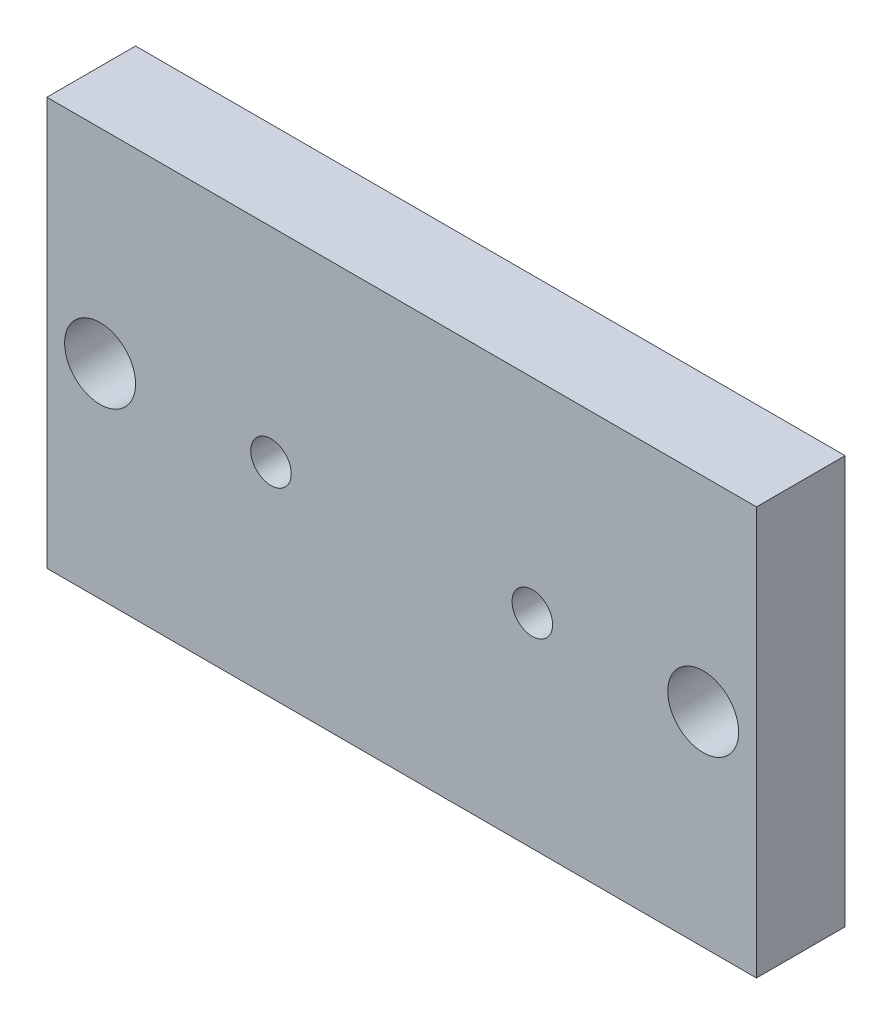
ISO-10303-21;
HEADER;
FILE_DESCRIPTION(('STEP AP214'),'2;1');
FILE_NAME('part.step','',(''),(''),'','','');
FILE_SCHEMA(('AUTOMOTIVE_DESIGN { 1 0 10303 214 1 1 1 1 }'));
ENDSEC;
DATA;
#1=APPLICATION_CONTEXT('core data for automotive mechanical design processes');
#2=APPLICATION_PROTOCOL_DEFINITION('international standard','automotive_design',2000,#1);
#3=PRODUCT_CONTEXT('',#1,'mechanical');
#4=PRODUCT('Part','Part','',(#3));
#5=PRODUCT_RELATED_PRODUCT_CATEGORY('part','',(#4));
#6=PRODUCT_DEFINITION_FORMATION('','',#4);
#7=PRODUCT_DEFINITION_CONTEXT('part definition',#1,'design');
#8=PRODUCT_DEFINITION('design','',#6,#7);
#9=PRODUCT_DEFINITION_SHAPE('','',#8);
#10=(LENGTH_UNIT() NAMED_UNIT(*) SI_UNIT(.MILLI.,.METRE.));
#11=(NAMED_UNIT(*) PLANE_ANGLE_UNIT() SI_UNIT($,.RADIAN.));
#12=(NAMED_UNIT(*) SI_UNIT($,.STERADIAN.) SOLID_ANGLE_UNIT());
#13=UNCERTAINTY_MEASURE_WITH_UNIT(LENGTH_MEASURE(1.E-05),#10,'distance_accuracy_value','');
#14=(GEOMETRIC_REPRESENTATION_CONTEXT(3) GLOBAL_UNCERTAINTY_ASSIGNED_CONTEXT((#13)) GLOBAL_UNIT_ASSIGNED_CONTEXT((#10,
#11,#12)) REPRESENTATION_CONTEXT('',''));
#15=CARTESIAN_POINT('',(0.,0.,0.));
#16=DIRECTION('',(0.,0.,1.));
#17=DIRECTION('',(1.,0.,0.));
#18=AXIS2_PLACEMENT_3D('',#15,#16,#17);
#19=CARTESIAN_POINT('',(-20.,11.5,5.));
#20=DIRECTION('',(1.,0.,0.));
#21=DIRECTION('',(0.,1.,0.));
#22=AXIS2_PLACEMENT_3D('',#19,#20,#21);
#23=PLANE('',#22);
#24=DIRECTION('',(0.,-1.,0.));
#25=VECTOR('',#24,1.);
#26=CARTESIAN_POINT('',(-20.,11.5,0.));
#27=LINE('',#26,#25);
#28=CARTESIAN_POINT('',(-20.,11.5,0.));
#29=VERTEX_POINT('',#28);
#30=CARTESIAN_POINT('',(-20.,-11.5,0.));
#31=VERTEX_POINT('',#30);
#32=EDGE_CURVE('E95',#29,#31,#27,.T.);
#33=ORIENTED_EDGE('',*,*,#32,.T.);
#34=DIRECTION('',(0.,0.,-1.));
#35=VECTOR('',#34,1.);
#36=CARTESIAN_POINT('',(-20.,-11.5,5.));
#37=LINE('',#36,#35);
#38=CARTESIAN_POINT('',(-20.,-11.5,5.));
#39=VERTEX_POINT('',#38);
#40=EDGE_CURVE('E11',#39,#31,#37,.T.);
#41=ORIENTED_EDGE('',*,*,#40,.F.);
#42=DIRECTION('',(0.,-1.,0.));
#43=VECTOR('',#42,1.);
#44=CARTESIAN_POINT('',(-20.,11.5,5.));
#45=LINE('',#44,#43);
#46=CARTESIAN_POINT('',(-20.,11.5,5.));
#47=VERTEX_POINT('',#46);
#48=EDGE_CURVE('E83',#47,#39,#45,.T.);
#49=ORIENTED_EDGE('',*,*,#48,.F.);
#50=DIRECTION('',(0.,0.,-1.));
#51=VECTOR('',#50,1.);
#52=CARTESIAN_POINT('',(-20.,11.5,5.));
#53=LINE('',#52,#51);
#54=EDGE_CURVE('E91',#47,#29,#53,.T.);
#55=ORIENTED_EDGE('',*,*,#54,.T.);
#56=EDGE_LOOP('',(#33,#41,#49,#55));
#57=FACE_BOUND('',#56,.T.);
#58=ADVANCED_FACE('F32',(#57),#23,.F.);
#59=CARTESIAN_POINT('',(-20.,-11.5,5.));
#60=DIRECTION('',(0.,1.,0.));
#61=DIRECTION('',(0.,0.,1.));
#62=AXIS2_PLACEMENT_3D('',#59,#60,#61);
#63=PLANE('',#62);
#64=DIRECTION('',(1.,0.,0.));
#65=VECTOR('',#64,1.);
#66=CARTESIAN_POINT('',(-20.,-11.5,0.));
#67=LINE('',#66,#65);
#68=CARTESIAN_POINT('',(20.,-11.5,0.));
#69=VERTEX_POINT('',#68);
#70=EDGE_CURVE('E87',#31,#69,#67,.T.);
#71=ORIENTED_EDGE('',*,*,#70,.T.);
#72=DIRECTION('',(0.,0.,-1.));
#73=VECTOR('',#72,1.);
#74=CARTESIAN_POINT('',(20.,-11.5,5.));
#75=LINE('',#74,#73);
#76=CARTESIAN_POINT('',(20.,-11.5,5.));
#77=VERTEX_POINT('',#76);
#78=EDGE_CURVE('E40',#77,#69,#75,.T.);
#79=ORIENTED_EDGE('',*,*,#78,.F.);
#80=DIRECTION('',(1.,0.,0.));
#81=VECTOR('',#80,1.);
#82=CARTESIAN_POINT('',(-20.,-11.5,5.));
#83=LINE('',#82,#81);
#84=EDGE_CURVE('E78',#39,#77,#83,.T.);
#85=ORIENTED_EDGE('',*,*,#84,.F.);
#86=ORIENTED_EDGE('',*,*,#40,.T.);
#87=EDGE_LOOP('',(#71,#79,#85,#86));
#88=FACE_BOUND('',#87,.T.);
#89=ADVANCED_FACE('F86',(#88),#63,.F.);
#90=CARTESIAN_POINT('',(20.,11.5,5.));
#91=DIRECTION('',(-1.,0.,0.));
#92=DIRECTION('',(0.,-1.,0.));
#93=AXIS2_PLACEMENT_3D('',#90,#91,#92);
#94=PLANE('',#93);
#95=DIRECTION('',(0.,1.,0.));
#96=VECTOR('',#95,1.);
#97=CARTESIAN_POINT('',(20.,11.5,0.));
#98=LINE('',#97,#96);
#99=CARTESIAN_POINT('',(20.,11.5,0.));
#100=VERTEX_POINT('',#99);
#101=EDGE_CURVE('E65',#69,#100,#98,.T.);
#102=ORIENTED_EDGE('',*,*,#101,.T.);
#103=DIRECTION('',(0.,0.,-1.));
#104=VECTOR('',#103,1.);
#105=CARTESIAN_POINT('',(20.,11.5,5.));
#106=LINE('',#105,#104);
#107=CARTESIAN_POINT('',(20.,11.5,5.));
#108=VERTEX_POINT('',#107);
#109=EDGE_CURVE('E88',#108,#100,#106,.T.);
#110=ORIENTED_EDGE('',*,*,#109,.F.);
#111=DIRECTION('',(0.,1.,0.));
#112=VECTOR('',#111,1.);
#113=CARTESIAN_POINT('',(20.,11.5,5.));
#114=LINE('',#113,#112);
#115=EDGE_CURVE('E81',#77,#108,#114,.T.);
#116=ORIENTED_EDGE('',*,*,#115,.F.);
#117=ORIENTED_EDGE('',*,*,#78,.T.);
#118=EDGE_LOOP('',(#102,#110,#116,#117));
#119=FACE_BOUND('',#118,.T.);
#120=ADVANCED_FACE('F89',(#119),#94,.F.);
#121=CARTESIAN_POINT('',(-20.,11.5,5.));
#122=DIRECTION('',(0.,-1.,0.));
#123=DIRECTION('',(0.,0.,-1.));
#124=AXIS2_PLACEMENT_3D('',#121,#122,#123);
#125=PLANE('',#124);
#126=DIRECTION('',(-1.,0.,0.));
#127=VECTOR('',#126,1.);
#128=CARTESIAN_POINT('',(-20.,11.5,0.));
#129=LINE('',#128,#127);
#130=EDGE_CURVE('E71',#100,#29,#129,.T.);
#131=ORIENTED_EDGE('',*,*,#130,.T.);
#132=ORIENTED_EDGE('',*,*,#54,.F.);
#133=DIRECTION('',(-1.,0.,0.));
#134=VECTOR('',#133,1.);
#135=CARTESIAN_POINT('',(-20.,11.5,5.));
#136=LINE('',#135,#134);
#137=EDGE_CURVE('E48',#108,#47,#136,.T.);
#138=ORIENTED_EDGE('',*,*,#137,.F.);
#139=ORIENTED_EDGE('',*,*,#109,.T.);
#140=EDGE_LOOP('',(#131,#132,#138,#139));
#141=FACE_BOUND('',#140,.T.);
#142=ADVANCED_FACE('F103',(#141),#125,.F.);
#143=CARTESIAN_POINT('',(0.,0.,5.));
#144=DIRECTION('',(0.,0.,1.));
#145=DIRECTION('',(1.,0.,0.));
#146=AXIS2_PLACEMENT_3D('',#143,#144,#145);
#147=PLANE('',#146);
#148=CARTESIAN_POINT('',(16.9999999999999,0.,5.));
#149=DIRECTION('',(0.,0.,1.));
#150=DIRECTION('',(1.,0.,0.));
#151=AXIS2_PLACEMENT_3D('',#148,#149,#150);
#152=CIRCLE('',#151,2.00000000000001);
#153=CARTESIAN_POINT('',(18.9999999999999,0.,5.));
#154=VERTEX_POINT('',#153);
#155=EDGE_CURVE('E98',#154,#154,#152,.T.);
#156=ORIENTED_EDGE('',*,*,#155,.F.);
#157=EDGE_LOOP('',(#156));
#158=FACE_BOUND('',#157,.T.);
#159=CARTESIAN_POINT('',(7.36599999999997,0.,5.));
#160=DIRECTION('',(0.,0.,1.));
#161=DIRECTION('',(1.,0.,0.));
#162=AXIS2_PLACEMENT_3D('',#159,#160,#161);
#163=CIRCLE('',#162,1.143);
#164=CARTESIAN_POINT('',(8.50899999999997,0.,5.));
#165=VERTEX_POINT('',#164);
#166=EDGE_CURVE('E111',#165,#165,#163,.T.);
#167=ORIENTED_EDGE('',*,*,#166,.F.);
#168=EDGE_LOOP('',(#167));
#169=FACE_BOUND('',#168,.T.);
#170=CARTESIAN_POINT('',(-7.36600000000003,0.,5.));
#171=DIRECTION('',(0.,0.,1.));
#172=DIRECTION('',(1.,0.,0.));
#173=AXIS2_PLACEMENT_3D('',#170,#171,#172);
#174=CIRCLE('',#173,1.143);
#175=CARTESIAN_POINT('',(-6.22300000000003,0.,5.));
#176=VERTEX_POINT('',#175);
#177=EDGE_CURVE('E114',#176,#176,#174,.T.);
#178=ORIENTED_EDGE('',*,*,#177,.F.);
#179=EDGE_LOOP('',(#178));
#180=FACE_BOUND('',#179,.T.);
#181=CARTESIAN_POINT('',(-17.0000000000001,0.,5.));
#182=DIRECTION('',(0.,0.,1.));
#183=DIRECTION('',(1.,0.,0.));
#184=AXIS2_PLACEMENT_3D('',#181,#182,#183);
#185=CIRCLE('',#184,2.);
#186=CARTESIAN_POINT('',(-15.0000000000001,0.,5.));
#187=VERTEX_POINT('',#186);
#188=EDGE_CURVE('E117',#187,#187,#185,.T.);
#189=ORIENTED_EDGE('',*,*,#188,.F.);
#190=EDGE_LOOP('',(#189));
#191=FACE_BOUND('',#190,.T.);
#192=ORIENTED_EDGE('',*,*,#48,.T.);
#193=ORIENTED_EDGE('',*,*,#84,.T.);
#194=ORIENTED_EDGE('',*,*,#115,.T.);
#195=ORIENTED_EDGE('',*,*,#137,.T.);
#196=EDGE_LOOP('',(#192,#193,#194,#195));
#197=FACE_BOUND('',#196,.T.);
#198=ADVANCED_FACE('F79',(#158,#169,#180,#191,#197),#147,.T.);
#199=CARTESIAN_POINT('',(0.,0.,0.));
#200=DIRECTION('',(0.,0.,1.));
#201=DIRECTION('',(1.,0.,0.));
#202=AXIS2_PLACEMENT_3D('',#199,#200,#201);
#203=PLANE('',#202);
#204=CARTESIAN_POINT('',(16.9999999999999,0.,0.));
#205=DIRECTION('',(0.,0.,-1.));
#206=DIRECTION('',(-1.,0.,0.));
#207=AXIS2_PLACEMENT_3D('',#204,#205,#206);
#208=CIRCLE('',#207,2.00000000000001);
#209=CARTESIAN_POINT('',(14.9999999999999,0.,0.));
#210=VERTEX_POINT('',#209);
#211=EDGE_CURVE('E120',#210,#210,#208,.T.);
#212=ORIENTED_EDGE('',*,*,#211,.F.);
#213=EDGE_LOOP('',(#212));
#214=FACE_BOUND('',#213,.T.);
#215=CARTESIAN_POINT('',(7.36599999999997,0.,0.));
#216=DIRECTION('',(0.,0.,-1.));
#217=DIRECTION('',(-1.,0.,0.));
#218=AXIS2_PLACEMENT_3D('',#215,#216,#217);
#219=CIRCLE('',#218,1.143);
#220=CARTESIAN_POINT('',(6.22299999999997,0.,0.));
#221=VERTEX_POINT('',#220);
#222=EDGE_CURVE('E127',#221,#221,#219,.T.);
#223=ORIENTED_EDGE('',*,*,#222,.F.);
#224=EDGE_LOOP('',(#223));
#225=FACE_BOUND('',#224,.T.);
#226=CARTESIAN_POINT('',(-7.36600000000003,0.,0.));
#227=DIRECTION('',(0.,0.,-1.));
#228=DIRECTION('',(-1.,0.,0.));
#229=AXIS2_PLACEMENT_3D('',#226,#227,#228);
#230=CIRCLE('',#229,1.143);
#231=CARTESIAN_POINT('',(-8.50900000000003,0.,0.));
#232=VERTEX_POINT('',#231);
#233=EDGE_CURVE('E124',#232,#232,#230,.T.);
#234=ORIENTED_EDGE('',*,*,#233,.F.);
#235=EDGE_LOOP('',(#234));
#236=FACE_BOUND('',#235,.T.);
#237=CARTESIAN_POINT('',(-17.0000000000001,0.,0.));
#238=DIRECTION('',(0.,0.,-1.));
#239=DIRECTION('',(-1.,0.,0.));
#240=AXIS2_PLACEMENT_3D('',#237,#238,#239);
#241=CIRCLE('',#240,2.);
#242=CARTESIAN_POINT('',(-19.0000000000001,0.,0.));
#243=VERTEX_POINT('',#242);
#244=EDGE_CURVE('E121',#243,#243,#241,.T.);
#245=ORIENTED_EDGE('',*,*,#244,.F.);
#246=EDGE_LOOP('',(#245));
#247=FACE_BOUND('',#246,.T.);
#248=ORIENTED_EDGE('',*,*,#32,.F.);
#249=ORIENTED_EDGE('',*,*,#130,.F.);
#250=ORIENTED_EDGE('',*,*,#101,.F.);
#251=ORIENTED_EDGE('',*,*,#70,.F.);
#252=EDGE_LOOP('',(#248,#249,#250,#251));
#253=FACE_BOUND('',#252,.T.);
#254=ADVANCED_FACE('F106',(#214,#225,#236,#247,#253),#203,.F.);
#255=CARTESIAN_POINT('',(-17.0000000000001,0.,10.));
#256=DIRECTION('',(0.,0.,-1.));
#257=DIRECTION('',(-1.,0.,0.));
#258=AXIS2_PLACEMENT_3D('',#255,#256,#257);
#259=CYLINDRICAL_SURFACE('',#258,2.);
#260=ORIENTED_EDGE('',*,*,#188,.T.);
#261=EDGE_LOOP('',(#260));
#262=FACE_BOUND('',#261,.T.);
#263=ORIENTED_EDGE('',*,*,#244,.T.);
#264=EDGE_LOOP('',(#263));
#265=FACE_BOUND('',#264,.T.);
#266=ADVANCED_FACE('F137',(#262,#265),#259,.F.);
#267=CARTESIAN_POINT('',(-7.36600000000003,0.,10.));
#268=DIRECTION('',(0.,0.,-1.));
#269=DIRECTION('',(-1.,0.,0.));
#270=AXIS2_PLACEMENT_3D('',#267,#268,#269);
#271=CYLINDRICAL_SURFACE('',#270,1.143);
#272=ORIENTED_EDGE('',*,*,#177,.T.);
#273=EDGE_LOOP('',(#272));
#274=FACE_BOUND('',#273,.T.);
#275=ORIENTED_EDGE('',*,*,#233,.T.);
#276=EDGE_LOOP('',(#275));
#277=FACE_BOUND('',#276,.T.);
#278=ADVANCED_FACE('F146',(#274,#277),#271,.F.);
#279=CARTESIAN_POINT('',(7.36599999999997,0.,10.));
#280=DIRECTION('',(0.,0.,-1.));
#281=DIRECTION('',(-1.,0.,0.));
#282=AXIS2_PLACEMENT_3D('',#279,#280,#281);
#283=CYLINDRICAL_SURFACE('',#282,1.143);
#284=ORIENTED_EDGE('',*,*,#166,.T.);
#285=EDGE_LOOP('',(#284));
#286=FACE_BOUND('',#285,.T.);
#287=ORIENTED_EDGE('',*,*,#222,.T.);
#288=EDGE_LOOP('',(#287));
#289=FACE_BOUND('',#288,.T.);
#290=ADVANCED_FACE('F152',(#286,#289),#283,.F.);
#291=CARTESIAN_POINT('',(16.9999999999999,0.,10.));
#292=DIRECTION('',(0.,0.,-1.));
#293=DIRECTION('',(-1.,0.,0.));
#294=AXIS2_PLACEMENT_3D('',#291,#292,#293);
#295=CYLINDRICAL_SURFACE('',#294,2.00000000000001);
#296=ORIENTED_EDGE('',*,*,#155,.T.);
#297=EDGE_LOOP('',(#296));
#298=FACE_BOUND('',#297,.T.);
#299=ORIENTED_EDGE('',*,*,#211,.T.);
#300=EDGE_LOOP('',(#299));
#301=FACE_BOUND('',#300,.T.);
#302=ADVANCED_FACE('F133',(#298,#301),#295,.F.);
#303=CLOSED_SHELL('',(#58,#89,#120,#142,#198,#254,#266,#278,#290,#302));
#304=MANIFOLD_SOLID_BREP('B2',#303);
#305=ADVANCED_BREP_SHAPE_REPRESENTATION('',(#18,#304),#14);
#306=SHAPE_DEFINITION_REPRESENTATION(#9,#305);
ENDSEC;
END-ISO-10303-21;
